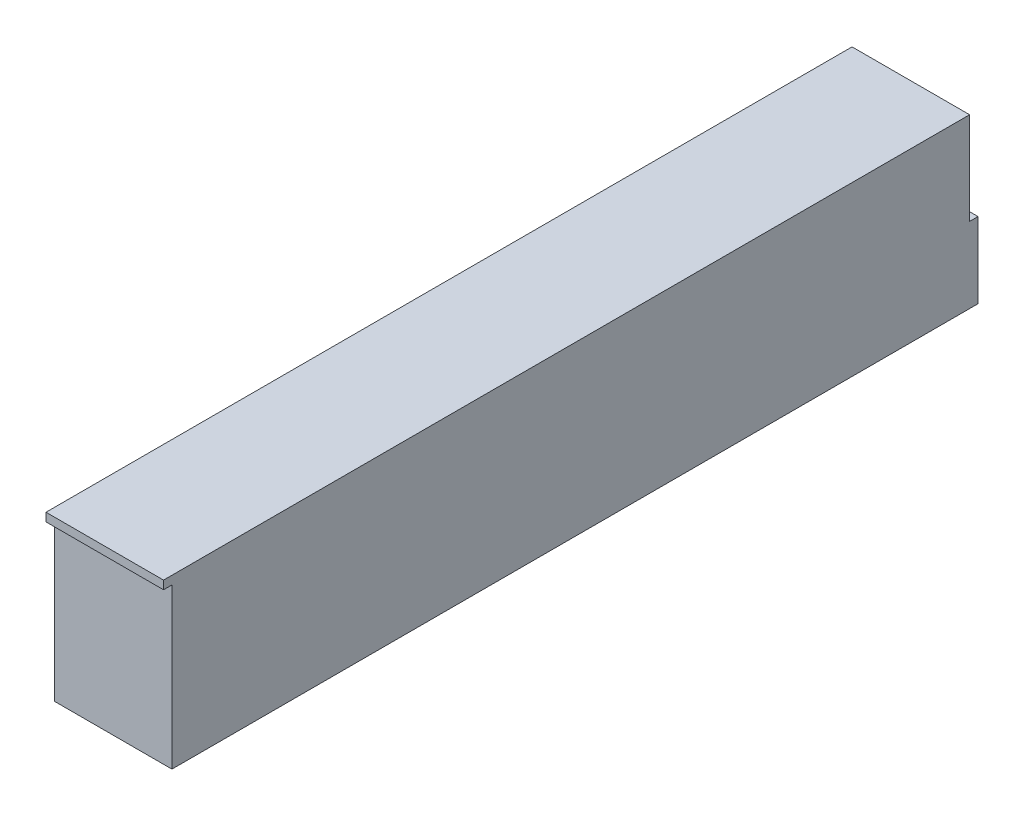
ISO-10303-21;
HEADER;
FILE_DESCRIPTION(('STEP AP214'),'2;1');
FILE_NAME('part.step','',(''),(''),'','','');
FILE_SCHEMA(('AUTOMOTIVE_DESIGN { 1 0 10303 214 1 1 1 1 }'));
ENDSEC;
DATA;
#1=APPLICATION_CONTEXT('core data for automotive mechanical design processes');
#2=APPLICATION_PROTOCOL_DEFINITION('international standard','automotive_design',2000,#1);
#3=PRODUCT_CONTEXT('',#1,'mechanical');
#4=PRODUCT('Part','Part','',(#3));
#5=PRODUCT_RELATED_PRODUCT_CATEGORY('part','',(#4));
#6=PRODUCT_DEFINITION_FORMATION('','',#4);
#7=PRODUCT_DEFINITION_CONTEXT('part definition',#1,'design');
#8=PRODUCT_DEFINITION('design','',#6,#7);
#9=PRODUCT_DEFINITION_SHAPE('','',#8);
#10=(LENGTH_UNIT() NAMED_UNIT(*) SI_UNIT(.MILLI.,.METRE.));
#11=(NAMED_UNIT(*) PLANE_ANGLE_UNIT() SI_UNIT($,.RADIAN.));
#12=(NAMED_UNIT(*) SI_UNIT($,.STERADIAN.) SOLID_ANGLE_UNIT());
#13=UNCERTAINTY_MEASURE_WITH_UNIT(LENGTH_MEASURE(1.E-05),#10,'distance_accuracy_value','');
#14=(GEOMETRIC_REPRESENTATION_CONTEXT(3) GLOBAL_UNCERTAINTY_ASSIGNED_CONTEXT((#13)) GLOBAL_UNIT_ASSIGNED_CONTEXT((#10,
#11,#12)) REPRESENTATION_CONTEXT('',''));
#15=CARTESIAN_POINT('',(0.,0.,0.));
#16=DIRECTION('',(0.,0.,1.));
#17=DIRECTION('',(1.,0.,0.));
#18=AXIS2_PLACEMENT_3D('',#15,#16,#17);
#19=CARTESIAN_POINT('',(0.,31.75,-152.4));
#20=DIRECTION('',(0.,0.,1.));
#21=DIRECTION('',(1.,0.,0.));
#22=AXIS2_PLACEMENT_3D('',#19,#20,#21);
#23=PLANE('',#22);
#24=DIRECTION('',(1.,0.,0.));
#25=VECTOR('',#24,1.);
#26=CARTESIAN_POINT('',(-14.3754239067931,14.2875,-152.4));
#27=LINE('',#26,#25);
#28=CARTESIAN_POINT('',(0.,14.2875,-152.4));
#29=VERTEX_POINT('',#28);
#30=CARTESIAN_POINT('',(22.225,14.2875,-152.4));
#31=VERTEX_POINT('',#30);
#32=EDGE_CURVE('E55',#29,#31,#27,.T.);
#33=ORIENTED_EDGE('',*,*,#32,.F.);
#34=DIRECTION('',(0.,-1.,0.));
#35=VECTOR('',#34,1.);
#36=CARTESIAN_POINT('',(0.,31.75,-152.4));
#37=LINE('',#36,#35);
#38=CARTESIAN_POINT('',(0.,31.75,-152.4));
#39=VERTEX_POINT('',#38);
#40=EDGE_CURVE('E187',#39,#29,#37,.T.);
#41=ORIENTED_EDGE('',*,*,#40,.F.);
#42=DIRECTION('',(-1.,0.,0.));
#43=VECTOR('',#42,1.);
#44=CARTESIAN_POINT('',(0.,31.75,-152.4));
#45=LINE('',#44,#43);
#46=CARTESIAN_POINT('',(22.225,31.75,-152.4));
#47=VERTEX_POINT('',#46);
#48=EDGE_CURVE('E175',#47,#39,#45,.T.);
#49=ORIENTED_EDGE('',*,*,#48,.F.);
#50=DIRECTION('',(0.,-1.,0.));
#51=VECTOR('',#50,1.);
#52=CARTESIAN_POINT('',(22.225,31.75,-152.4));
#53=LINE('',#52,#51);
#54=EDGE_CURVE('E48',#47,#31,#53,.T.);
#55=ORIENTED_EDGE('',*,*,#54,.T.);
#56=EDGE_LOOP('',(#33,#41,#49,#55));
#57=FACE_BOUND('',#56,.T.);
#58=ADVANCED_FACE('F39',(#57),#23,.F.);
#59=CARTESIAN_POINT('',(22.225,31.75,0.));
#60=DIRECTION('',(0.,0.,-1.));
#61=DIRECTION('',(-1.,0.,0.));
#62=AXIS2_PLACEMENT_3D('',#59,#60,#61);
#63=PLANE('',#62);
#64=DIRECTION('',(0.,-1.,0.));
#65=VECTOR('',#64,1.);
#66=CARTESIAN_POINT('',(0.,31.75,0.));
#67=LINE('',#66,#65);
#68=CARTESIAN_POINT('',(0.,31.75,0.));
#69=VERTEX_POINT('',#68);
#70=CARTESIAN_POINT('',(0.,30.1625,0.));
#71=VERTEX_POINT('',#70);
#72=EDGE_CURVE('E180',#69,#71,#67,.T.);
#73=ORIENTED_EDGE('',*,*,#72,.T.);
#74=DIRECTION('',(1.,0.,0.));
#75=VECTOR('',#74,1.);
#76=CARTESIAN_POINT('',(0.,30.1625,0.));
#77=LINE('',#76,#75);
#78=CARTESIAN_POINT('',(22.225,30.1625,0.));
#79=VERTEX_POINT('',#78);
#80=EDGE_CURVE('E120',#71,#79,#77,.T.);
#81=ORIENTED_EDGE('',*,*,#80,.T.);
#82=DIRECTION('',(0.,-1.,0.));
#83=VECTOR('',#82,1.);
#84=CARTESIAN_POINT('',(22.225,31.75,0.));
#85=LINE('',#84,#83);
#86=CARTESIAN_POINT('',(22.225,31.75,0.));
#87=VERTEX_POINT('',#86);
#88=EDGE_CURVE('E11',#87,#79,#85,.T.);
#89=ORIENTED_EDGE('',*,*,#88,.F.);
#90=DIRECTION('',(1.,0.,0.));
#91=VECTOR('',#90,1.);
#92=CARTESIAN_POINT('',(22.225,31.75,0.));
#93=LINE('',#92,#91);
#94=EDGE_CURVE('E168',#69,#87,#93,.T.);
#95=ORIENTED_EDGE('',*,*,#94,.F.);
#96=EDGE_LOOP('',(#73,#81,#89,#95));
#97=FACE_BOUND('',#96,.T.);
#98=ADVANCED_FACE('F41',(#97),#63,.F.);
#99=CARTESIAN_POINT('',(22.225,31.75,-152.4));
#100=DIRECTION('',(-1.,0.,0.));
#101=DIRECTION('',(0.,0.,1.));
#102=AXIS2_PLACEMENT_3D('',#99,#100,#101);
#103=PLANE('',#102);
#104=ORIENTED_EDGE('',*,*,#88,.T.);
#105=DIRECTION('',(0.,0.,1.));
#106=VECTOR('',#105,1.);
#107=CARTESIAN_POINT('',(22.225,30.1625,0.));
#108=LINE('',#107,#106);
#109=CARTESIAN_POINT('',(22.225,30.1625,-1.5875));
#110=VERTEX_POINT('',#109);
#111=EDGE_CURVE('E151',#110,#79,#108,.T.);
#112=ORIENTED_EDGE('',*,*,#111,.F.);
#113=DIRECTION('',(0.,1.,0.));
#114=VECTOR('',#113,1.);
#115=CARTESIAN_POINT('',(22.225,0.,-1.5875));
#116=LINE('',#115,#114);
#117=CARTESIAN_POINT('',(22.225,0.,-1.5875));
#118=VERTEX_POINT('',#117);
#119=EDGE_CURVE('E116',#118,#110,#116,.T.);
#120=ORIENTED_EDGE('',*,*,#119,.F.);
#121=DIRECTION('',(0.,0.,-1.));
#122=VECTOR('',#121,1.);
#123=CARTESIAN_POINT('',(22.225,0.,-152.4));
#124=LINE('',#123,#122);
#125=CARTESIAN_POINT('',(22.225,0.,-153.9875));
#126=VERTEX_POINT('',#125);
#127=EDGE_CURVE('E107',#118,#126,#124,.T.);
#128=ORIENTED_EDGE('',*,*,#127,.T.);
#129=DIRECTION('',(0.,1.,0.));
#130=VECTOR('',#129,1.);
#131=CARTESIAN_POINT('',(22.225,0.,-153.9875));
#132=LINE('',#131,#130);
#133=CARTESIAN_POINT('',(22.225,14.2875,-153.9875));
#134=VERTEX_POINT('',#133);
#135=EDGE_CURVE('E112',#126,#134,#132,.T.);
#136=ORIENTED_EDGE('',*,*,#135,.T.);
#137=DIRECTION('',(0.,0.,1.));
#138=VECTOR('',#137,1.);
#139=CARTESIAN_POINT('',(22.225,14.2875,-152.4));
#140=LINE('',#139,#138);
#141=EDGE_CURVE('E131',#134,#31,#140,.T.);
#142=ORIENTED_EDGE('',*,*,#141,.T.);
#143=ORIENTED_EDGE('',*,*,#54,.F.);
#144=DIRECTION('',(0.,0.,-1.));
#145=VECTOR('',#144,1.);
#146=CARTESIAN_POINT('',(22.225,31.75,-152.4));
#147=LINE('',#146,#145);
#148=EDGE_CURVE('E172',#87,#47,#147,.T.);
#149=ORIENTED_EDGE('',*,*,#148,.F.);
#150=EDGE_LOOP('',(#104,#112,#120,#128,#136,#142,#143,#149));
#151=FACE_BOUND('',#150,.T.);
#152=ADVANCED_FACE('F109',(#151),#103,.F.);
#153=CARTESIAN_POINT('',(0.,31.75,0.));
#154=DIRECTION('',(1.,0.,0.));
#155=DIRECTION('',(0.,0.,-1.));
#156=AXIS2_PLACEMENT_3D('',#153,#154,#155);
#157=PLANE('',#156);
#158=DIRECTION('',(0.,1.,0.));
#159=VECTOR('',#158,1.);
#160=CARTESIAN_POINT('',(0.,0.,-1.5875));
#161=LINE('',#160,#159);
#162=CARTESIAN_POINT('',(0.,0.,-1.5875));
#163=VERTEX_POINT('',#162);
#164=CARTESIAN_POINT('',(0.,30.1625,-1.5875));
#165=VERTEX_POINT('',#164);
#166=EDGE_CURVE('E63',#163,#165,#161,.T.);
#167=ORIENTED_EDGE('',*,*,#166,.T.);
#168=DIRECTION('',(0.,0.,1.));
#169=VECTOR('',#168,1.);
#170=CARTESIAN_POINT('',(0.,30.1625,0.));
#171=LINE('',#170,#169);
#172=EDGE_CURVE('E150',#165,#71,#171,.T.);
#173=ORIENTED_EDGE('',*,*,#172,.T.);
#174=ORIENTED_EDGE('',*,*,#72,.F.);
#175=DIRECTION('',(0.,0.,1.));
#176=VECTOR('',#175,1.);
#177=CARTESIAN_POINT('',(0.,31.75,0.));
#178=LINE('',#177,#176);
#179=EDGE_CURVE('E178',#39,#69,#178,.T.);
#180=ORIENTED_EDGE('',*,*,#179,.F.);
#181=ORIENTED_EDGE('',*,*,#40,.T.);
#182=DIRECTION('',(0.,0.,-1.));
#183=VECTOR('',#182,1.);
#184=CARTESIAN_POINT('',(0.,14.2875,-152.4));
#185=LINE('',#184,#183);
#186=CARTESIAN_POINT('',(0.,14.2875,-153.9875));
#187=VERTEX_POINT('',#186);
#188=EDGE_CURVE('E140',#29,#187,#185,.T.);
#189=ORIENTED_EDGE('',*,*,#188,.T.);
#190=DIRECTION('',(0.,-1.,0.));
#191=VECTOR('',#190,1.);
#192=CARTESIAN_POINT('',(0.,0.,-153.9875));
#193=LINE('',#192,#191);
#194=CARTESIAN_POINT('',(0.,0.,-153.9875));
#195=VERTEX_POINT('',#194);
#196=EDGE_CURVE('E145',#187,#195,#193,.T.);
#197=ORIENTED_EDGE('',*,*,#196,.T.);
#198=DIRECTION('',(0.,0.,1.));
#199=VECTOR('',#198,1.);
#200=CARTESIAN_POINT('',(0.,0.,0.));
#201=LINE('',#200,#199);
#202=EDGE_CURVE('E119',#195,#163,#201,.T.);
#203=ORIENTED_EDGE('',*,*,#202,.T.);
#204=EDGE_LOOP('',(#167,#173,#174,#180,#181,#189,#197,#203));
#205=FACE_BOUND('',#204,.T.);
#206=ADVANCED_FACE('F198',(#205),#157,.F.);
#207=CARTESIAN_POINT('',(0.,31.75,0.));
#208=DIRECTION('',(0.,-1.,0.));
#209=DIRECTION('',(0.,0.,-1.));
#210=AXIS2_PLACEMENT_3D('',#207,#208,#209);
#211=PLANE('',#210);
#212=ORIENTED_EDGE('',*,*,#94,.T.);
#213=ORIENTED_EDGE('',*,*,#148,.T.);
#214=ORIENTED_EDGE('',*,*,#48,.T.);
#215=ORIENTED_EDGE('',*,*,#179,.T.);
#216=EDGE_LOOP('',(#212,#213,#214,#215));
#217=FACE_BOUND('',#216,.T.);
#218=ADVANCED_FACE('F207',(#217),#211,.F.);
#219=CARTESIAN_POINT('',(0.,0.,0.));
#220=DIRECTION('',(0.,-1.,0.));
#221=DIRECTION('',(0.,0.,-1.));
#222=AXIS2_PLACEMENT_3D('',#219,#220,#221);
#223=PLANE('',#222);
#224=DIRECTION('',(1.,0.,0.));
#225=VECTOR('',#224,1.);
#226=CARTESIAN_POINT('',(0.,0.,-1.5875));
#227=LINE('',#226,#225);
#228=EDGE_CURVE('E155',#163,#118,#227,.T.);
#229=ORIENTED_EDGE('',*,*,#228,.F.);
#230=ORIENTED_EDGE('',*,*,#202,.F.);
#231=DIRECTION('',(1.,0.,0.));
#232=VECTOR('',#231,1.);
#233=CARTESIAN_POINT('',(-14.3754239067931,0.,-153.9875));
#234=LINE('',#233,#232);
#235=EDGE_CURVE('E123',#195,#126,#234,.T.);
#236=ORIENTED_EDGE('',*,*,#235,.T.);
#237=ORIENTED_EDGE('',*,*,#127,.F.);
#238=EDGE_LOOP('',(#229,#230,#236,#237));
#239=FACE_BOUND('',#238,.T.);
#240=ADVANCED_FACE('F124',(#239),#223,.T.);
#241=CARTESIAN_POINT('',(0.,30.1625,0.));
#242=DIRECTION('',(0.,1.,0.));
#243=DIRECTION('',(0.,0.,1.));
#244=AXIS2_PLACEMENT_3D('',#241,#242,#243);
#245=PLANE('',#244);
#246=ORIENTED_EDGE('',*,*,#111,.T.);
#247=ORIENTED_EDGE('',*,*,#80,.F.);
#248=ORIENTED_EDGE('',*,*,#172,.F.);
#249=DIRECTION('',(1.,0.,0.));
#250=VECTOR('',#249,1.);
#251=CARTESIAN_POINT('',(0.,30.1625,-1.5875));
#252=LINE('',#251,#250);
#253=EDGE_CURVE('E163',#165,#110,#252,.T.);
#254=ORIENTED_EDGE('',*,*,#253,.T.);
#255=EDGE_LOOP('',(#246,#247,#248,#254));
#256=FACE_BOUND('',#255,.T.);
#257=ADVANCED_FACE('F208',(#256),#245,.F.);
#258=CARTESIAN_POINT('',(0.,0.,-1.5875));
#259=DIRECTION('',(0.,0.,-1.));
#260=DIRECTION('',(-1.,0.,0.));
#261=AXIS2_PLACEMENT_3D('',#258,#259,#260);
#262=PLANE('',#261);
#263=ORIENTED_EDGE('',*,*,#119,.T.);
#264=ORIENTED_EDGE('',*,*,#253,.F.);
#265=ORIENTED_EDGE('',*,*,#166,.F.);
#266=ORIENTED_EDGE('',*,*,#228,.T.);
#267=EDGE_LOOP('',(#263,#264,#265,#266));
#268=FACE_BOUND('',#267,.T.);
#269=ADVANCED_FACE('F209',(#268),#262,.F.);
#270=CARTESIAN_POINT('',(-14.3754239067931,14.2875,-152.4));
#271=DIRECTION('',(0.,1.,0.));
#272=DIRECTION('',(0.,0.,1.));
#273=AXIS2_PLACEMENT_3D('',#270,#271,#272);
#274=PLANE('',#273);
#275=ORIENTED_EDGE('',*,*,#188,.F.);
#276=ORIENTED_EDGE('',*,*,#32,.T.);
#277=ORIENTED_EDGE('',*,*,#141,.F.);
#278=DIRECTION('',(1.,0.,0.));
#279=VECTOR('',#278,1.);
#280=CARTESIAN_POINT('',(-14.3754239067931,14.2875,-153.9875));
#281=LINE('',#280,#279);
#282=EDGE_CURVE('E130',#187,#134,#281,.T.);
#283=ORIENTED_EDGE('',*,*,#282,.F.);
#284=EDGE_LOOP('',(#275,#276,#277,#283));
#285=FACE_BOUND('',#284,.T.);
#286=ADVANCED_FACE('F194',(#285),#274,.T.);
#287=CARTESIAN_POINT('',(-14.3754239067931,0.,-153.9875));
#288=DIRECTION('',(0.,0.,-1.));
#289=DIRECTION('',(-1.,0.,0.));
#290=AXIS2_PLACEMENT_3D('',#287,#288,#289);
#291=PLANE('',#290);
#292=ORIENTED_EDGE('',*,*,#196,.F.);
#293=ORIENTED_EDGE('',*,*,#282,.T.);
#294=ORIENTED_EDGE('',*,*,#135,.F.);
#295=ORIENTED_EDGE('',*,*,#235,.F.);
#296=EDGE_LOOP('',(#292,#293,#294,#295));
#297=FACE_BOUND('',#296,.T.);
#298=ADVANCED_FACE('F133',(#297),#291,.T.);
#299=CLOSED_SHELL('',(#58,#98,#152,#206,#218,#240,#257,#269,#286,#298));
#300=MANIFOLD_SOLID_BREP('B2',#299);
#301=ADVANCED_BREP_SHAPE_REPRESENTATION('',(#18,#300),#14);
#302=SHAPE_DEFINITION_REPRESENTATION(#9,#301);
ENDSEC;
END-ISO-10303-21;
